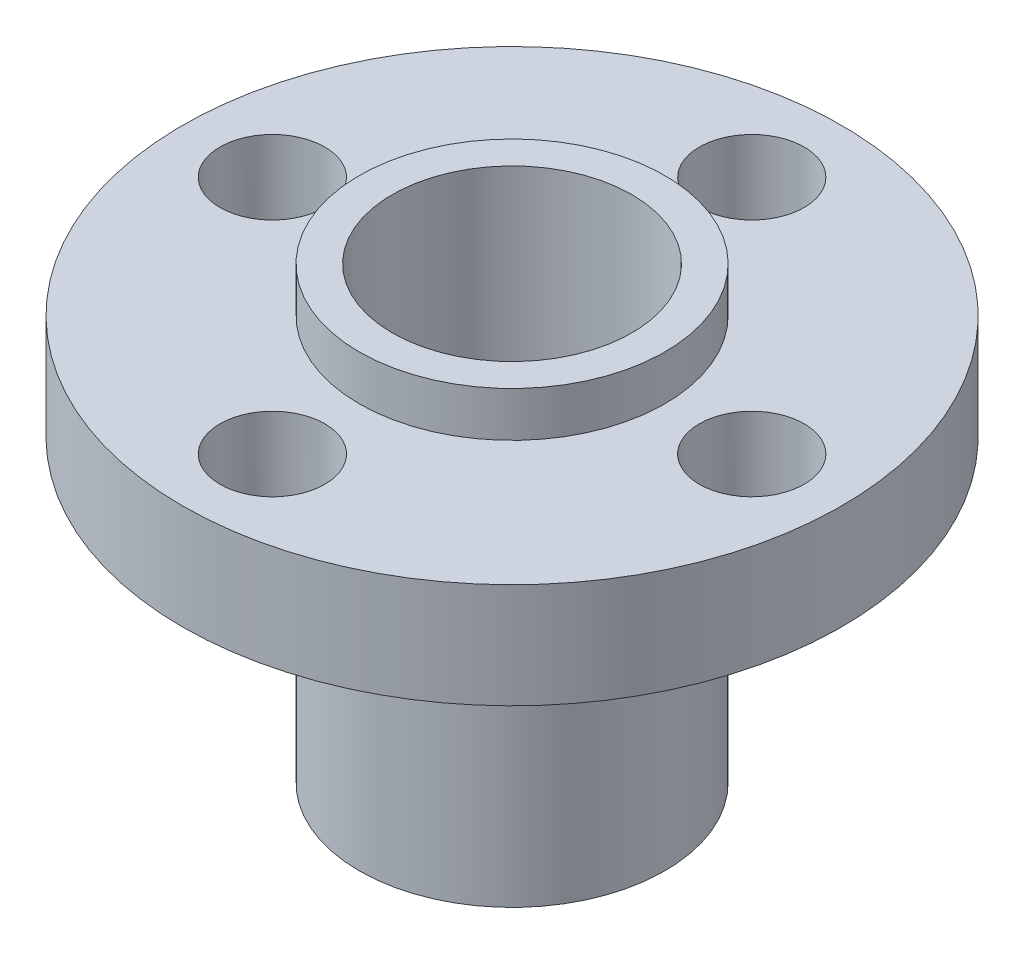
ISO-10303-21;
HEADER;
FILE_DESCRIPTION(('STEP AP214'),'2;1');
FILE_NAME('part.step','',(''),(''),'','','');
FILE_SCHEMA(('AUTOMOTIVE_DESIGN { 1 0 10303 214 1 1 1 1 }'));
ENDSEC;
DATA;
#1=APPLICATION_CONTEXT('core data for automotive mechanical design processes');
#2=APPLICATION_PROTOCOL_DEFINITION('international standard','automotive_design',2000,#1);
#3=PRODUCT_CONTEXT('',#1,'mechanical');
#4=PRODUCT('Part','Part','',(#3));
#5=PRODUCT_RELATED_PRODUCT_CATEGORY('part','',(#4));
#6=PRODUCT_DEFINITION_FORMATION('','',#4);
#7=PRODUCT_DEFINITION_CONTEXT('part definition',#1,'design');
#8=PRODUCT_DEFINITION('design','',#6,#7);
#9=PRODUCT_DEFINITION_SHAPE('','',#8);
#10=(LENGTH_UNIT() NAMED_UNIT(*) SI_UNIT(.MILLI.,.METRE.));
#11=(NAMED_UNIT(*) PLANE_ANGLE_UNIT() SI_UNIT($,.RADIAN.));
#12=(NAMED_UNIT(*) SI_UNIT($,.STERADIAN.) SOLID_ANGLE_UNIT());
#13=UNCERTAINTY_MEASURE_WITH_UNIT(LENGTH_MEASURE(1.E-05),#10,'distance_accuracy_value','');
#14=(GEOMETRIC_REPRESENTATION_CONTEXT(3) GLOBAL_UNCERTAINTY_ASSIGNED_CONTEXT((#13)) GLOBAL_UNIT_ASSIGNED_CONTEXT((#10,
#11,#12)) REPRESENTATION_CONTEXT('',''));
#15=CARTESIAN_POINT('',(0.,0.,0.));
#16=DIRECTION('',(0.,0.,1.));
#17=DIRECTION('',(1.,0.,0.));
#18=AXIS2_PLACEMENT_3D('',#15,#16,#17);
#19=CARTESIAN_POINT('',(0.,3.5,0.));
#20=DIRECTION('',(0.,-1.,0.));
#21=DIRECTION('',(0.,0.,-1.));
#22=AXIS2_PLACEMENT_3D('',#19,#20,#21);
#23=CYLINDRICAL_SURFACE('',#22,11.);
#24=CARTESIAN_POINT('',(0.,3.5,0.));
#25=DIRECTION('',(0.,1.,0.));
#26=DIRECTION('',(0.,0.,1.));
#27=AXIS2_PLACEMENT_3D('',#24,#25,#26);
#28=CIRCLE('',#27,11.);
#29=CARTESIAN_POINT('',(0.,3.5,11.));
#30=VERTEX_POINT('',#29);
#31=EDGE_CURVE('E42',#30,#30,#28,.T.);
#32=ORIENTED_EDGE('',*,*,#31,.F.);
#33=EDGE_LOOP('',(#32));
#34=FACE_BOUND('',#33,.T.);
#35=CARTESIAN_POINT('',(0.,0.,0.));
#36=DIRECTION('',(0.,1.,0.));
#37=DIRECTION('',(0.,0.,1.));
#38=AXIS2_PLACEMENT_3D('',#35,#36,#37);
#39=CIRCLE('',#38,11.);
#40=CARTESIAN_POINT('',(0.,0.,11.));
#41=VERTEX_POINT('',#40);
#42=EDGE_CURVE('E47',#41,#41,#39,.T.);
#43=ORIENTED_EDGE('',*,*,#42,.T.);
#44=EDGE_LOOP('',(#43));
#45=FACE_BOUND('',#44,.T.);
#46=ADVANCED_FACE('F35',(#34,#45),#23,.T.);
#47=CARTESIAN_POINT('',(0.,3.5,0.));
#48=DIRECTION('',(0.,1.,0.));
#49=DIRECTION('',(0.,0.,1.));
#50=AXIS2_PLACEMENT_3D('',#47,#48,#49);
#51=PLANE('',#50);
#52=CARTESIAN_POINT('',(0.,3.5,8.));
#53=DIRECTION('',(0.,1.,0.));
#54=DIRECTION('',(0.,0.,-1.));
#55=AXIS2_PLACEMENT_3D('',#52,#53,#54);
#56=CIRCLE('',#55,1.75);
#57=CARTESIAN_POINT('',(0.,3.5,6.25));
#58=VERTEX_POINT('',#57);
#59=EDGE_CURVE('E156',#58,#58,#56,.T.);
#60=ORIENTED_EDGE('',*,*,#59,.F.);
#61=EDGE_LOOP('',(#60));
#62=FACE_BOUND('',#61,.T.);
#63=CARTESIAN_POINT('',(-8.,3.5,0.));
#64=DIRECTION('',(0.,1.,0.));
#65=DIRECTION('',(1.,0.,0.));
#66=AXIS2_PLACEMENT_3D('',#63,#64,#65);
#67=CIRCLE('',#66,1.75);
#68=CARTESIAN_POINT('',(-6.25,3.5,0.));
#69=VERTEX_POINT('',#68);
#70=EDGE_CURVE('E157',#69,#69,#67,.T.);
#71=ORIENTED_EDGE('',*,*,#70,.F.);
#72=EDGE_LOOP('',(#71));
#73=FACE_BOUND('',#72,.T.);
#74=CARTESIAN_POINT('',(8.,3.5,0.));
#75=DIRECTION('',(0.,1.,0.));
#76=DIRECTION('',(-1.,0.,0.));
#77=AXIS2_PLACEMENT_3D('',#74,#75,#76);
#78=CIRCLE('',#77,1.75);
#79=CARTESIAN_POINT('',(6.25,3.5,0.));
#80=VERTEX_POINT('',#79);
#81=EDGE_CURVE('E66',#80,#80,#78,.T.);
#82=ORIENTED_EDGE('',*,*,#81,.F.);
#83=EDGE_LOOP('',(#82));
#84=FACE_BOUND('',#83,.T.);
#85=CARTESIAN_POINT('',(0.,3.5,-8.));
#86=DIRECTION('',(0.,1.,0.));
#87=DIRECTION('',(0.,0.,1.));
#88=AXIS2_PLACEMENT_3D('',#85,#86,#87);
#89=CIRCLE('',#88,1.75);
#90=CARTESIAN_POINT('',(0.,3.5,-6.25));
#91=VERTEX_POINT('',#90);
#92=EDGE_CURVE('E62',#91,#91,#89,.T.);
#93=ORIENTED_EDGE('',*,*,#92,.F.);
#94=EDGE_LOOP('',(#93));
#95=FACE_BOUND('',#94,.T.);
#96=CARTESIAN_POINT('',(0.,3.5,0.));
#97=DIRECTION('',(0.,1.,0.));
#98=DIRECTION('',(0.,0.,1.));
#99=AXIS2_PLACEMENT_3D('',#96,#97,#98);
#100=CIRCLE('',#99,5.1);
#101=CARTESIAN_POINT('',(0.,3.5,5.1));
#102=VERTEX_POINT('',#101);
#103=EDGE_CURVE('E10',#102,#102,#100,.T.);
#104=ORIENTED_EDGE('',*,*,#103,.F.);
#105=EDGE_LOOP('',(#104));
#106=FACE_BOUND('',#105,.T.);
#107=ORIENTED_EDGE('',*,*,#31,.T.);
#108=EDGE_LOOP('',(#107));
#109=FACE_BOUND('',#108,.T.);
#110=ADVANCED_FACE('F105',(#62,#73,#84,#95,#106,#109),#51,.T.);
#111=CARTESIAN_POINT('',(0.,0.,0.));
#112=DIRECTION('',(0.,1.,0.));
#113=DIRECTION('',(0.,0.,1.));
#114=AXIS2_PLACEMENT_3D('',#111,#112,#113);
#115=PLANE('',#114);
#116=CARTESIAN_POINT('',(0.,0.,8.));
#117=DIRECTION('',(0.,1.,0.));
#118=DIRECTION('',(0.,0.,1.));
#119=AXIS2_PLACEMENT_3D('',#116,#117,#118);
#120=CIRCLE('',#119,1.75);
#121=CARTESIAN_POINT('',(0.,0.,9.75));
#122=VERTEX_POINT('',#121);
#123=EDGE_CURVE('E38',#122,#122,#120,.T.);
#124=ORIENTED_EDGE('',*,*,#123,.T.);
#125=EDGE_LOOP('',(#124));
#126=FACE_BOUND('',#125,.T.);
#127=CARTESIAN_POINT('',(-8.,0.,0.));
#128=DIRECTION('',(0.,1.,0.));
#129=DIRECTION('',(0.,0.,1.));
#130=AXIS2_PLACEMENT_3D('',#127,#128,#129);
#131=CIRCLE('',#130,1.75);
#132=CARTESIAN_POINT('',(-8.,0.,1.74999999999992));
#133=VERTEX_POINT('',#132);
#134=EDGE_CURVE('E65',#133,#133,#131,.T.);
#135=ORIENTED_EDGE('',*,*,#134,.T.);
#136=EDGE_LOOP('',(#135));
#137=FACE_BOUND('',#136,.T.);
#138=CARTESIAN_POINT('',(8.,0.,0.));
#139=DIRECTION('',(0.,1.,0.));
#140=DIRECTION('',(0.,0.,1.));
#141=AXIS2_PLACEMENT_3D('',#138,#139,#140);
#142=CIRCLE('',#141,1.75);
#143=CARTESIAN_POINT('',(8.,0.,1.75000000000003));
#144=VERTEX_POINT('',#143);
#145=EDGE_CURVE('E63',#144,#144,#142,.T.);
#146=ORIENTED_EDGE('',*,*,#145,.T.);
#147=EDGE_LOOP('',(#146));
#148=FACE_BOUND('',#147,.T.);
#149=CARTESIAN_POINT('',(0.,0.,-8.));
#150=DIRECTION('',(0.,1.,0.));
#151=DIRECTION('',(0.,0.,1.));
#152=AXIS2_PLACEMENT_3D('',#149,#150,#151);
#153=CIRCLE('',#152,1.75);
#154=CARTESIAN_POINT('',(0.,0.,-6.25));
#155=VERTEX_POINT('',#154);
#156=EDGE_CURVE('E58',#155,#155,#153,.T.);
#157=ORIENTED_EDGE('',*,*,#156,.T.);
#158=EDGE_LOOP('',(#157));
#159=FACE_BOUND('',#158,.T.);
#160=CARTESIAN_POINT('',(0.,0.,0.));
#161=DIRECTION('',(0.,1.,0.));
#162=DIRECTION('',(0.,0.,1.));
#163=AXIS2_PLACEMENT_3D('',#160,#161,#162);
#164=CIRCLE('',#163,5.1);
#165=CARTESIAN_POINT('',(0.,0.,5.1));
#166=VERTEX_POINT('',#165);
#167=EDGE_CURVE('E55',#166,#166,#164,.T.);
#168=ORIENTED_EDGE('',*,*,#167,.T.);
#169=EDGE_LOOP('',(#168));
#170=FACE_BOUND('',#169,.T.);
#171=ORIENTED_EDGE('',*,*,#42,.F.);
#172=EDGE_LOOP('',(#171));
#173=FACE_BOUND('',#172,.T.);
#174=ADVANCED_FACE('F96',(#126,#137,#148,#159,#170,#173),#115,.F.);
#175=CARTESIAN_POINT('',(0.,-10.,0.));
#176=DIRECTION('',(0.,1.,0.));
#177=DIRECTION('',(0.,0.,1.));
#178=AXIS2_PLACEMENT_3D('',#175,#176,#177);
#179=PLANE('',#178);
#180=CARTESIAN_POINT('',(0.,-10.,0.));
#181=DIRECTION('',(0.,1.,0.));
#182=DIRECTION('',(0.,0.,1.));
#183=AXIS2_PLACEMENT_3D('',#180,#181,#182);
#184=CIRCLE('',#183,4.);
#185=CARTESIAN_POINT('',(0.,-10.,4.));
#186=VERTEX_POINT('',#185);
#187=EDGE_CURVE('E80',#186,#186,#184,.T.);
#188=ORIENTED_EDGE('',*,*,#187,.T.);
#189=EDGE_LOOP('',(#188));
#190=FACE_BOUND('',#189,.T.);
#191=CARTESIAN_POINT('',(0.,-10.,0.));
#192=DIRECTION('',(0.,1.,0.));
#193=DIRECTION('',(0.,0.,1.));
#194=AXIS2_PLACEMENT_3D('',#191,#192,#193);
#195=CIRCLE('',#194,5.1);
#196=CARTESIAN_POINT('',(0.,-10.,5.1));
#197=VERTEX_POINT('',#196);
#198=EDGE_CURVE('E50',#197,#197,#195,.T.);
#199=ORIENTED_EDGE('',*,*,#198,.F.);
#200=EDGE_LOOP('',(#199));
#201=FACE_BOUND('',#200,.T.);
#202=ADVANCED_FACE('F94',(#190,#201),#179,.F.);
#203=CARTESIAN_POINT('',(0.,-10.,0.));
#204=DIRECTION('',(0.,1.,0.));
#205=DIRECTION('',(0.,0.,1.));
#206=AXIS2_PLACEMENT_3D('',#203,#204,#205);
#207=CYLINDRICAL_SURFACE('',#206,5.1);
#208=ORIENTED_EDGE('',*,*,#198,.T.);
#209=EDGE_LOOP('',(#208));
#210=FACE_BOUND('',#209,.T.);
#211=ORIENTED_EDGE('',*,*,#167,.F.);
#212=EDGE_LOOP('',(#211));
#213=FACE_BOUND('',#212,.T.);
#214=ADVANCED_FACE('F91',(#210,#213),#207,.T.);
#215=ORIENTED_EDGE('',*,*,#103,.T.);
#216=EDGE_LOOP('',(#215));
#217=FACE_BOUND('',#216,.T.);
#218=CARTESIAN_POINT('',(0.,5.,0.));
#219=DIRECTION('',(0.,1.,0.));
#220=DIRECTION('',(0.,0.,1.));
#221=AXIS2_PLACEMENT_3D('',#218,#219,#220);
#222=CIRCLE('',#221,5.1);
#223=CARTESIAN_POINT('',(0.,5.,5.1));
#224=VERTEX_POINT('',#223);
#225=EDGE_CURVE('E83',#224,#224,#222,.T.);
#226=ORIENTED_EDGE('',*,*,#225,.F.);
#227=EDGE_LOOP('',(#226));
#228=FACE_BOUND('',#227,.T.);
#229=ADVANCED_FACE('F103',(#217,#228),#207,.T.);
#230=CARTESIAN_POINT('',(0.,5.,0.));
#231=DIRECTION('',(0.,1.,0.));
#232=DIRECTION('',(0.,0.,1.));
#233=AXIS2_PLACEMENT_3D('',#230,#231,#232);
#234=PLANE('',#233);
#235=CARTESIAN_POINT('',(0.,5.,0.));
#236=DIRECTION('',(0.,1.,0.));
#237=DIRECTION('',(0.,0.,1.));
#238=AXIS2_PLACEMENT_3D('',#235,#236,#237);
#239=CIRCLE('',#238,4.);
#240=CARTESIAN_POINT('',(0.,5.,4.));
#241=VERTEX_POINT('',#240);
#242=EDGE_CURVE('E61',#241,#241,#239,.T.);
#243=ORIENTED_EDGE('',*,*,#242,.F.);
#244=EDGE_LOOP('',(#243));
#245=FACE_BOUND('',#244,.T.);
#246=ORIENTED_EDGE('',*,*,#225,.T.);
#247=EDGE_LOOP('',(#246));
#248=FACE_BOUND('',#247,.T.);
#249=ADVANCED_FACE('F124',(#245,#248),#234,.T.);
#250=CARTESIAN_POINT('',(0.,-10.,0.));
#251=DIRECTION('',(0.,1.,0.));
#252=DIRECTION('',(0.,0.,1.));
#253=AXIS2_PLACEMENT_3D('',#250,#251,#252);
#254=CYLINDRICAL_SURFACE('',#253,4.);
#255=ORIENTED_EDGE('',*,*,#187,.F.);
#256=EDGE_LOOP('',(#255));
#257=FACE_BOUND('',#256,.T.);
#258=ORIENTED_EDGE('',*,*,#242,.T.);
#259=EDGE_LOOP('',(#258));
#260=FACE_BOUND('',#259,.T.);
#261=ADVANCED_FACE('F128',(#257,#260),#254,.F.);
#262=CARTESIAN_POINT('',(0.,-10.,-8.));
#263=DIRECTION('',(0.,1.,0.));
#264=DIRECTION('',(0.,0.,1.));
#265=AXIS2_PLACEMENT_3D('',#262,#263,#264);
#266=CYLINDRICAL_SURFACE('',#265,1.75);
#267=ORIENTED_EDGE('',*,*,#92,.T.);
#268=EDGE_LOOP('',(#267));
#269=FACE_BOUND('',#268,.T.);
#270=ORIENTED_EDGE('',*,*,#156,.F.);
#271=EDGE_LOOP('',(#270));
#272=FACE_BOUND('',#271,.T.);
#273=ADVANCED_FACE('F134',(#269,#272),#266,.F.);
#274=CARTESIAN_POINT('',(8.,-10.,0.));
#275=DIRECTION('',(0.,1.,0.));
#276=DIRECTION('',(0.,0.,1.));
#277=AXIS2_PLACEMENT_3D('',#274,#275,#276);
#278=CYLINDRICAL_SURFACE('',#277,1.75);
#279=ORIENTED_EDGE('',*,*,#81,.T.);
#280=EDGE_LOOP('',(#279));
#281=FACE_BOUND('',#280,.T.);
#282=ORIENTED_EDGE('',*,*,#145,.F.);
#283=EDGE_LOOP('',(#282));
#284=FACE_BOUND('',#283,.T.);
#285=ADVANCED_FACE('F141',(#281,#284),#278,.F.);
#286=CARTESIAN_POINT('',(-8.,-10.,0.));
#287=DIRECTION('',(0.,1.,0.));
#288=DIRECTION('',(0.,0.,1.));
#289=AXIS2_PLACEMENT_3D('',#286,#287,#288);
#290=CYLINDRICAL_SURFACE('',#289,1.75);
#291=ORIENTED_EDGE('',*,*,#70,.T.);
#292=EDGE_LOOP('',(#291));
#293=FACE_BOUND('',#292,.T.);
#294=ORIENTED_EDGE('',*,*,#134,.F.);
#295=EDGE_LOOP('',(#294));
#296=FACE_BOUND('',#295,.T.);
#297=ADVANCED_FACE('F144',(#293,#296),#290,.F.);
#298=CARTESIAN_POINT('',(0.,-10.,8.));
#299=DIRECTION('',(0.,1.,0.));
#300=DIRECTION('',(0.,0.,1.));
#301=AXIS2_PLACEMENT_3D('',#298,#299,#300);
#302=CYLINDRICAL_SURFACE('',#301,1.75);
#303=ORIENTED_EDGE('',*,*,#59,.T.);
#304=EDGE_LOOP('',(#303));
#305=FACE_BOUND('',#304,.T.);
#306=ORIENTED_EDGE('',*,*,#123,.F.);
#307=EDGE_LOOP('',(#306));
#308=FACE_BOUND('',#307,.T.);
#309=ADVANCED_FACE('F148',(#305,#308),#302,.F.);
#310=CLOSED_SHELL('',(#46,#110,#174,#202,#214,#229,#249,#261,#273,#285,#297,#309));
#311=MANIFOLD_SOLID_BREP('B2',#310);
#312=ADVANCED_BREP_SHAPE_REPRESENTATION('',(#18,#311),#14);
#313=SHAPE_DEFINITION_REPRESENTATION(#9,#312);
ENDSEC;
END-ISO-10303-21;
